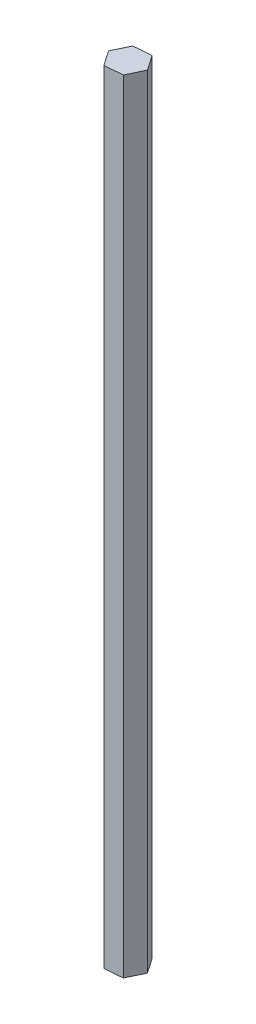
ISO-10303-21;
HEADER;
FILE_DESCRIPTION(('STEP AP214'),'2;1');
FILE_NAME('part.step','',(''),(''),'','','');
FILE_SCHEMA(('AUTOMOTIVE_DESIGN { 1 0 10303 214 1 1 1 1 }'));
ENDSEC;
DATA;
#1=APPLICATION_CONTEXT('core data for automotive mechanical design processes');
#2=APPLICATION_PROTOCOL_DEFINITION('international standard','automotive_design',2000,#1);
#3=PRODUCT_CONTEXT('',#1,'mechanical');
#4=PRODUCT('Part','Part','',(#3));
#5=PRODUCT_RELATED_PRODUCT_CATEGORY('part','',(#4));
#6=PRODUCT_DEFINITION_FORMATION('','',#4);
#7=PRODUCT_DEFINITION_CONTEXT('part definition',#1,'design');
#8=PRODUCT_DEFINITION('design','',#6,#7);
#9=PRODUCT_DEFINITION_SHAPE('','',#8);
#10=(LENGTH_UNIT() NAMED_UNIT(*) SI_UNIT(.MILLI.,.METRE.));
#11=(NAMED_UNIT(*) PLANE_ANGLE_UNIT() SI_UNIT($,.RADIAN.));
#12=(NAMED_UNIT(*) SI_UNIT($,.STERADIAN.) SOLID_ANGLE_UNIT());
#13=UNCERTAINTY_MEASURE_WITH_UNIT(LENGTH_MEASURE(1.E-05),#10,'distance_accuracy_value','');
#14=(GEOMETRIC_REPRESENTATION_CONTEXT(3) GLOBAL_UNCERTAINTY_ASSIGNED_CONTEXT((#13)) GLOBAL_UNIT_ASSIGNED_CONTEXT((#10,
#11,#12)) REPRESENTATION_CONTEXT('',''));
#15=CARTESIAN_POINT('',(0.,0.,0.));
#16=DIRECTION('',(0.,0.,1.));
#17=DIRECTION('',(1.,0.,0.));
#18=AXIS2_PLACEMENT_3D('',#15,#16,#17);
#19=CARTESIAN_POINT('',(4.13547581585345,158.75,6.0548470756762));
#20=DIRECTION('',(-0.901327961208321,0.,-0.433137283484175));
#21=DIRECTION('',(-0.433137283484175,0.,0.901327961208321));
#22=AXIS2_PLACEMENT_3D('',#19,#20,#21);
#23=PLANE('',#22);
#24=DIRECTION('',(0.433137283484175,0.,-0.901327961208322));
#25=VECTOR('',#24,1.);
#26=CARTESIAN_POINT('',(4.13547581585345,-158.75,6.0548470756762));
#27=LINE('',#26,#25);
#28=CARTESIAN_POINT('',(4.13547581585345,-158.75,6.0548470756762));
#29=VERTEX_POINT('',#28);
#30=CARTESIAN_POINT('',(7.31138929149223,-158.75,-0.554003575427169));
#31=VERTEX_POINT('',#30);
#32=EDGE_CURVE('E119',#29,#31,#27,.T.);
#33=ORIENTED_EDGE('',*,*,#32,.T.);
#34=DIRECTION('',(0.,-1.,0.));
#35=VECTOR('',#34,1.);
#36=CARTESIAN_POINT('',(7.31138929149223,158.75,-0.554003575427169));
#37=LINE('',#36,#35);
#38=CARTESIAN_POINT('',(7.31138929149223,158.75,-0.554003575427169));
#39=VERTEX_POINT('',#38);
#40=EDGE_CURVE('E11',#39,#31,#37,.T.);
#41=ORIENTED_EDGE('',*,*,#40,.F.);
#42=DIRECTION('',(0.433137283484175,0.,-0.901327961208322));
#43=VECTOR('',#42,1.);
#44=CARTESIAN_POINT('',(4.13547581585345,158.75,6.0548470756762));
#45=LINE('',#44,#43);
#46=CARTESIAN_POINT('',(4.13547581585345,158.75,6.0548470756762));
#47=VERTEX_POINT('',#46);
#48=EDGE_CURVE('E129',#47,#39,#45,.T.);
#49=ORIENTED_EDGE('',*,*,#48,.F.);
#50=DIRECTION('',(0.,-1.,0.));
#51=VECTOR('',#50,1.);
#52=CARTESIAN_POINT('',(4.13547581585345,158.75,6.0548470756762));
#53=LINE('',#52,#51);
#54=EDGE_CURVE('E115',#47,#29,#53,.T.);
#55=ORIENTED_EDGE('',*,*,#54,.T.);
#56=EDGE_LOOP('',(#33,#41,#49,#55));
#57=FACE_BOUND('',#56,.T.);
#58=ADVANCED_FACE('F35',(#57),#23,.F.);
#59=CARTESIAN_POINT('',(7.31138929149223,158.75,-0.554003575427169));
#60=DIRECTION('',(-0.825771871427639,0.,0.564004269805553));
#61=DIRECTION('',(0.564004269805554,0.,0.825771871427639));
#62=AXIS2_PLACEMENT_3D('',#59,#60,#61);
#63=PLANE('',#62);
#64=DIRECTION('',(-0.564004269805554,0.,-0.825771871427639));
#65=VECTOR('',#64,1.);
#66=CARTESIAN_POINT('',(7.31138929149223,-158.75,-0.554003575427169));
#67=LINE('',#66,#65);
#68=CARTESIAN_POINT('',(3.17591347563878,-158.75,-6.60885065110336));
#69=VERTEX_POINT('',#68);
#70=EDGE_CURVE('E122',#31,#69,#67,.T.);
#71=ORIENTED_EDGE('',*,*,#70,.T.);
#72=DIRECTION('',(0.,-1.,0.));
#73=VECTOR('',#72,1.);
#74=CARTESIAN_POINT('',(3.17591347563878,158.75,-6.60885065110336));
#75=LINE('',#74,#73);
#76=CARTESIAN_POINT('',(3.17591347563878,158.75,-6.60885065110336));
#77=VERTEX_POINT('',#76);
#78=EDGE_CURVE('E43',#77,#69,#75,.T.);
#79=ORIENTED_EDGE('',*,*,#78,.F.);
#80=DIRECTION('',(-0.564004269805554,0.,-0.825771871427639));
#81=VECTOR('',#80,1.);
#82=CARTESIAN_POINT('',(7.31138929149223,158.75,-0.554003575427169));
#83=LINE('',#82,#81);
#84=EDGE_CURVE('E88',#39,#77,#83,.T.);
#85=ORIENTED_EDGE('',*,*,#84,.F.);
#86=ORIENTED_EDGE('',*,*,#40,.T.);
#87=EDGE_LOOP('',(#71,#79,#85,#86));
#88=FACE_BOUND('',#87,.T.);
#89=ADVANCED_FACE('F153',(#88),#63,.F.);
#90=CARTESIAN_POINT('',(3.17591347563878,158.75,-6.60885065110336));
#91=DIRECTION('',(0.0755560897806826,0.,0.997141553289729));
#92=DIRECTION('',(0.997141553289729,0.,-0.0755560897806826));
#93=AXIS2_PLACEMENT_3D('',#90,#91,#92);
#94=PLANE('',#93);
#95=DIRECTION('',(-0.997141553289729,0.,0.0755560897806826));
#96=VECTOR('',#95,1.);
#97=CARTESIAN_POINT('',(3.17591347563878,-158.75,-6.60885065110336));
#98=LINE('',#97,#96);
#99=CARTESIAN_POINT('',(-4.13547581585345,-158.75,-6.0548470756762));
#100=VERTEX_POINT('',#99);
#101=EDGE_CURVE('E124',#69,#100,#98,.T.);
#102=ORIENTED_EDGE('',*,*,#101,.T.);
#103=DIRECTION('',(0.,-1.,0.));
#104=VECTOR('',#103,1.);
#105=CARTESIAN_POINT('',(-4.13547581585345,158.75,-6.0548470756762));
#106=LINE('',#105,#104);
#107=CARTESIAN_POINT('',(-4.13547581585345,158.75,-6.0548470756762));
#108=VERTEX_POINT('',#107);
#109=EDGE_CURVE('E110',#108,#100,#106,.T.);
#110=ORIENTED_EDGE('',*,*,#109,.F.);
#111=DIRECTION('',(-0.997141553289729,0.,0.0755560897806826));
#112=VECTOR('',#111,1.);
#113=CARTESIAN_POINT('',(3.17591347563878,158.75,-6.60885065110336));
#114=LINE('',#113,#112);
#115=EDGE_CURVE('E101',#77,#108,#114,.T.);
#116=ORIENTED_EDGE('',*,*,#115,.F.);
#117=ORIENTED_EDGE('',*,*,#78,.T.);
#118=EDGE_LOOP('',(#102,#110,#116,#117));
#119=FACE_BOUND('',#118,.T.);
#120=ADVANCED_FACE('F135',(#119),#94,.F.);
#121=CARTESIAN_POINT('',(-4.13547581585345,158.75,-6.0548470756762));
#122=DIRECTION('',(0.901327961208321,0.,0.433137283484175));
#123=DIRECTION('',(0.433137283484175,0.,-0.901327961208322));
#124=AXIS2_PLACEMENT_3D('',#121,#122,#123);
#125=PLANE('',#124);
#126=DIRECTION('',(-0.433137283484175,0.,0.901327961208321));
#127=VECTOR('',#126,1.);
#128=CARTESIAN_POINT('',(-4.13547581585345,-158.75,-6.0548470756762));
#129=LINE('',#128,#127);
#130=CARTESIAN_POINT('',(-7.31138929149223,-158.75,0.55400357542717));
#131=VERTEX_POINT('',#130);
#132=EDGE_CURVE('E109',#100,#131,#129,.T.);
#133=ORIENTED_EDGE('',*,*,#132,.T.);
#134=DIRECTION('',(0.,-1.,0.));
#135=VECTOR('',#134,1.);
#136=CARTESIAN_POINT('',(-7.31138929149223,158.75,0.55400357542717));
#137=LINE('',#136,#135);
#138=CARTESIAN_POINT('',(-7.31138929149223,158.75,0.55400357542717));
#139=VERTEX_POINT('',#138);
#140=EDGE_CURVE('E106',#139,#131,#137,.T.);
#141=ORIENTED_EDGE('',*,*,#140,.F.);
#142=DIRECTION('',(-0.433137283484175,0.,0.901327961208321));
#143=VECTOR('',#142,1.);
#144=CARTESIAN_POINT('',(-4.13547581585345,158.75,-6.0548470756762));
#145=LINE('',#144,#143);
#146=EDGE_CURVE('E95',#108,#139,#145,.T.);
#147=ORIENTED_EDGE('',*,*,#146,.F.);
#148=ORIENTED_EDGE('',*,*,#109,.T.);
#149=EDGE_LOOP('',(#133,#141,#147,#148));
#150=FACE_BOUND('',#149,.T.);
#151=ADVANCED_FACE('F107',(#150),#125,.F.);
#152=CARTESIAN_POINT('',(-7.31138929149223,158.75,0.55400357542717));
#153=DIRECTION('',(0.825771871427638,0.,-0.564004269805554));
#154=DIRECTION('',(-0.564004269805554,0.,-0.825771871427638));
#155=AXIS2_PLACEMENT_3D('',#152,#153,#154);
#156=PLANE('',#155);
#157=DIRECTION('',(0.564004269805554,0.,0.825771871427638));
#158=VECTOR('',#157,1.);
#159=CARTESIAN_POINT('',(-7.31138929149223,-158.75,0.55400357542717));
#160=LINE('',#159,#158);
#161=CARTESIAN_POINT('',(-3.17591347563878,-158.75,6.60885065110336));
#162=VERTEX_POINT('',#161);
#163=EDGE_CURVE('E74',#131,#162,#160,.T.);
#164=ORIENTED_EDGE('',*,*,#163,.T.);
#165=DIRECTION('',(0.,-1.,0.));
#166=VECTOR('',#165,1.);
#167=CARTESIAN_POINT('',(-3.17591347563878,158.75,6.60885065110336));
#168=LINE('',#167,#166);
#169=CARTESIAN_POINT('',(-3.17591347563878,158.75,6.60885065110336));
#170=VERTEX_POINT('',#169);
#171=EDGE_CURVE('E111',#170,#162,#168,.T.);
#172=ORIENTED_EDGE('',*,*,#171,.F.);
#173=DIRECTION('',(0.564004269805554,0.,0.825771871427638));
#174=VECTOR('',#173,1.);
#175=CARTESIAN_POINT('',(-7.31138929149223,158.75,0.55400357542717));
#176=LINE('',#175,#174);
#177=EDGE_CURVE('E99',#139,#170,#176,.T.);
#178=ORIENTED_EDGE('',*,*,#177,.F.);
#179=ORIENTED_EDGE('',*,*,#140,.T.);
#180=EDGE_LOOP('',(#164,#172,#178,#179));
#181=FACE_BOUND('',#180,.T.);
#182=ADVANCED_FACE('F113',(#181),#156,.F.);
#183=CARTESIAN_POINT('',(-3.17591347563878,158.75,6.60885065110336));
#184=DIRECTION('',(-0.0755560897806825,0.,-0.997141553289729));
#185=DIRECTION('',(-0.997141553289729,0.,0.0755560897806825));
#186=AXIS2_PLACEMENT_3D('',#183,#184,#185);
#187=PLANE('',#186);
#188=DIRECTION('',(0.997141553289729,0.,-0.0755560897806825));
#189=VECTOR('',#188,1.);
#190=CARTESIAN_POINT('',(-3.17591347563878,-158.75,6.60885065110336));
#191=LINE('',#190,#189);
#192=EDGE_CURVE('E80',#162,#29,#191,.T.);
#193=ORIENTED_EDGE('',*,*,#192,.T.);
#194=ORIENTED_EDGE('',*,*,#54,.F.);
#195=DIRECTION('',(0.997141553289729,0.,-0.0755560897806825));
#196=VECTOR('',#195,1.);
#197=CARTESIAN_POINT('',(-3.17591347563878,158.75,6.60885065110336));
#198=LINE('',#197,#196);
#199=EDGE_CURVE('E51',#170,#47,#198,.T.);
#200=ORIENTED_EDGE('',*,*,#199,.F.);
#201=ORIENTED_EDGE('',*,*,#171,.T.);
#202=EDGE_LOOP('',(#193,#194,#200,#201));
#203=FACE_BOUND('',#202,.T.);
#204=ADVANCED_FACE('F142',(#203),#187,.F.);
#205=CARTESIAN_POINT('',(0.,158.75,0.));
#206=DIRECTION('',(0.,1.,0.));
#207=DIRECTION('',(0.,0.,1.));
#208=AXIS2_PLACEMENT_3D('',#205,#206,#207);
#209=PLANE('',#208);
#210=ORIENTED_EDGE('',*,*,#48,.T.);
#211=ORIENTED_EDGE('',*,*,#84,.T.);
#212=ORIENTED_EDGE('',*,*,#115,.T.);
#213=ORIENTED_EDGE('',*,*,#146,.T.);
#214=ORIENTED_EDGE('',*,*,#177,.T.);
#215=ORIENTED_EDGE('',*,*,#199,.T.);
#216=EDGE_LOOP('',(#210,#211,#212,#213,#214,#215));
#217=FACE_BOUND('',#216,.T.);
#218=ADVANCED_FACE('F97',(#217),#209,.T.);
#219=CARTESIAN_POINT('',(0.,-158.75,0.));
#220=DIRECTION('',(0.,1.,0.));
#221=DIRECTION('',(0.,0.,1.));
#222=AXIS2_PLACEMENT_3D('',#219,#220,#221);
#223=PLANE('',#222);
#224=ORIENTED_EDGE('',*,*,#32,.F.);
#225=ORIENTED_EDGE('',*,*,#192,.F.);
#226=ORIENTED_EDGE('',*,*,#163,.F.);
#227=ORIENTED_EDGE('',*,*,#132,.F.);
#228=ORIENTED_EDGE('',*,*,#101,.F.);
#229=ORIENTED_EDGE('',*,*,#70,.F.);
#230=EDGE_LOOP('',(#224,#225,#226,#227,#228,#229));
#231=FACE_BOUND('',#230,.T.);
#232=ADVANCED_FACE('F138',(#231),#223,.F.);
#233=CLOSED_SHELL('',(#58,#89,#120,#151,#182,#204,#218,#232));
#234=MANIFOLD_SOLID_BREP('B2',#233);
#235=ADVANCED_BREP_SHAPE_REPRESENTATION('',(#18,#234),#14);
#236=SHAPE_DEFINITION_REPRESENTATION(#9,#235);
ENDSEC;
END-ISO-10303-21;
